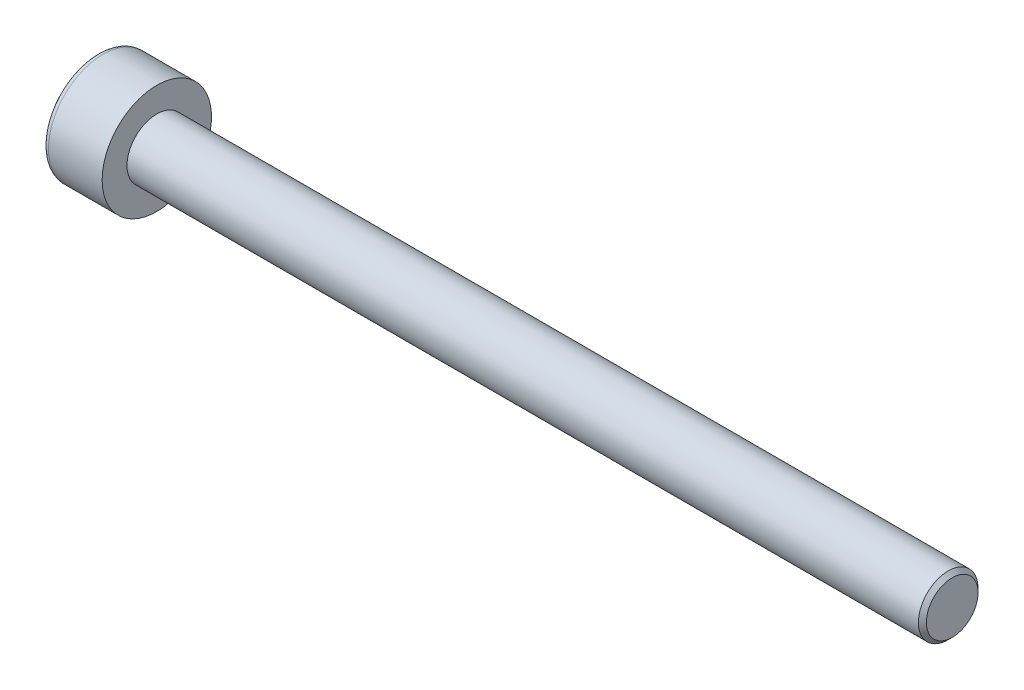
ISO-10303-21;
HEADER;
FILE_DESCRIPTION(('STEP AP214'),'2;1');
FILE_NAME('part.step','',(''),(''),'','','');
FILE_SCHEMA(('AUTOMOTIVE_DESIGN { 1 0 10303 214 1 1 1 1 }'));
ENDSEC;
DATA;
#1=APPLICATION_CONTEXT('core data for automotive mechanical design processes');
#2=APPLICATION_PROTOCOL_DEFINITION('international standard','automotive_design',2000,#1);
#3=PRODUCT_CONTEXT('',#1,'mechanical');
#4=PRODUCT('Part','Part','',(#3));
#5=PRODUCT_RELATED_PRODUCT_CATEGORY('part','',(#4));
#6=PRODUCT_DEFINITION_FORMATION('','',#4);
#7=PRODUCT_DEFINITION_CONTEXT('part definition',#1,'design');
#8=PRODUCT_DEFINITION('design','',#6,#7);
#9=PRODUCT_DEFINITION_SHAPE('','',#8);
#10=(LENGTH_UNIT() NAMED_UNIT(*) SI_UNIT(.MILLI.,.METRE.));
#11=(NAMED_UNIT(*) PLANE_ANGLE_UNIT() SI_UNIT($,.RADIAN.));
#12=(NAMED_UNIT(*) SI_UNIT($,.STERADIAN.) SOLID_ANGLE_UNIT());
#13=UNCERTAINTY_MEASURE_WITH_UNIT(LENGTH_MEASURE(1.E-05),#10,'distance_accuracy_value','');
#14=(GEOMETRIC_REPRESENTATION_CONTEXT(3) GLOBAL_UNCERTAINTY_ASSIGNED_CONTEXT((#13)) GLOBAL_UNIT_ASSIGNED_CONTEXT((#10,
#11,#12)) REPRESENTATION_CONTEXT('',''));
#15=CARTESIAN_POINT('',(0.,0.,0.));
#16=DIRECTION('',(0.,0.,1.));
#17=DIRECTION('',(1.,0.,0.));
#18=AXIS2_PLACEMENT_3D('',#15,#16,#17);
#19=CARTESIAN_POINT('',(0.,0.,0.));
#20=DIRECTION('',(1.,0.,0.));
#21=DIRECTION('',(0.,0.,-1.));
#22=AXIS2_PLACEMENT_3D('',#19,#20,#21);
#23=PLANE('',#22);
#24=DIRECTION('',(0.,0.866025403784438,-0.5));
#25=VECTOR('',#24,1.);
#26=CARTESIAN_POINT('',(0.,0.,1.44337567297406));
#27=LINE('',#26,#25);
#28=CARTESIAN_POINT('',(0.,0.,1.44337567297406));
#29=VERTEX_POINT('',#28);
#30=CARTESIAN_POINT('',(0.,1.25,0.721687836487032));
#31=VERTEX_POINT('',#30);
#32=EDGE_CURVE('E126',#29,#31,#27,.T.);
#33=ORIENTED_EDGE('',*,*,#32,.F.);
#34=DIRECTION('',(0.,0.866025403784439,0.5));
#35=VECTOR('',#34,1.);
#36=CARTESIAN_POINT('',(0.,-1.25,0.721687836487032));
#37=LINE('',#36,#35);
#38=CARTESIAN_POINT('',(0.,-1.25,0.721687836487032));
#39=VERTEX_POINT('',#38);
#40=EDGE_CURVE('E52',#39,#29,#37,.T.);
#41=ORIENTED_EDGE('',*,*,#40,.F.);
#42=DIRECTION('',(0.,0.,1.));
#43=VECTOR('',#42,1.);
#44=CARTESIAN_POINT('',(0.,-1.25,-0.721687836487032));
#45=LINE('',#44,#43);
#46=CARTESIAN_POINT('',(0.,-1.25,-0.721687836487032));
#47=VERTEX_POINT('',#46);
#48=EDGE_CURVE('E135',#47,#39,#45,.T.);
#49=ORIENTED_EDGE('',*,*,#48,.F.);
#50=DIRECTION('',(0.,-0.866025403784439,0.5));
#51=VECTOR('',#50,1.);
#52=CARTESIAN_POINT('',(0.,0.,-1.44337567297406));
#53=LINE('',#52,#51);
#54=CARTESIAN_POINT('',(0.,0.,-1.44337567297406));
#55=VERTEX_POINT('',#54);
#56=EDGE_CURVE('E133',#55,#47,#53,.T.);
#57=ORIENTED_EDGE('',*,*,#56,.F.);
#58=DIRECTION('',(0.,-0.866025403784439,-0.5));
#59=VECTOR('',#58,1.);
#60=CARTESIAN_POINT('',(0.,1.25,-0.721687836487032));
#61=LINE('',#60,#59);
#62=CARTESIAN_POINT('',(0.,1.25,-0.721687836487032));
#63=VERTEX_POINT('',#62);
#64=EDGE_CURVE('E100',#63,#55,#61,.T.);
#65=ORIENTED_EDGE('',*,*,#64,.F.);
#66=DIRECTION('',(0.,0.,-1.));
#67=VECTOR('',#66,1.);
#68=CARTESIAN_POINT('',(0.,1.25,0.721687836487032));
#69=LINE('',#68,#67);
#70=EDGE_CURVE('E129',#31,#63,#69,.T.);
#71=ORIENTED_EDGE('',*,*,#70,.F.);
#72=EDGE_LOOP('',(#33,#41,#49,#57,#65,#71));
#73=FACE_BOUND('',#72,.T.);
#74=CARTESIAN_POINT('',(0.,0.,0.));
#75=DIRECTION('',(-1.,0.,0.));
#76=DIRECTION('',(0.,0.,1.));
#77=AXIS2_PLACEMENT_3D('',#74,#75,#76);
#78=CIRCLE('',#77,2.45);
#79=CARTESIAN_POINT('',(0.,0.,2.45));
#80=VERTEX_POINT('',#79);
#81=EDGE_CURVE('E11',#80,#80,#78,.T.);
#82=ORIENTED_EDGE('',*,*,#81,.T.);
#83=EDGE_LOOP('',(#82));
#84=FACE_BOUND('',#83,.T.);
#85=ADVANCED_FACE('F38',(#73,#84),#23,.F.);
#86=CARTESIAN_POINT('',(0.3,0.,0.));
#87=DIRECTION('',(-1.,0.,0.));
#88=DIRECTION('',(0.,0.,1.));
#89=AXIS2_PLACEMENT_3D('',#86,#87,#88);
#90=TOROIDAL_SURFACE('',#89,2.45,0.3);
#91=ORIENTED_EDGE('',*,*,#81,.F.);
#92=EDGE_LOOP('',(#91));
#93=FACE_BOUND('',#92,.T.);
#94=CARTESIAN_POINT('',(0.300000000000002,0.,0.));
#95=DIRECTION('',(-1.,0.,0.));
#96=DIRECTION('',(0.,0.,1.));
#97=AXIS2_PLACEMENT_3D('',#94,#95,#96);
#98=CIRCLE('',#97,2.75);
#99=CARTESIAN_POINT('',(0.300000000000002,0.,2.75));
#100=VERTEX_POINT('',#99);
#101=EDGE_CURVE('E45',#100,#100,#98,.T.);
#102=ORIENTED_EDGE('',*,*,#101,.T.);
#103=EDGE_LOOP('',(#102));
#104=FACE_BOUND('',#103,.T.);
#105=ADVANCED_FACE('F158',(#93,#104),#90,.T.);
#106=CARTESIAN_POINT('',(0.,0.,0.));
#107=DIRECTION('',(-1.,0.,0.));
#108=DIRECTION('',(0.,0.,1.));
#109=AXIS2_PLACEMENT_3D('',#106,#107,#108);
#110=CYLINDRICAL_SURFACE('',#109,2.75);
#111=ORIENTED_EDGE('',*,*,#101,.F.);
#112=EDGE_LOOP('',(#111));
#113=FACE_BOUND('',#112,.T.);
#114=CARTESIAN_POINT('',(3.,0.,0.));
#115=DIRECTION('',(-1.,0.,0.));
#116=DIRECTION('',(0.,0.,1.));
#117=AXIS2_PLACEMENT_3D('',#114,#115,#116);
#118=CIRCLE('',#117,2.75);
#119=CARTESIAN_POINT('',(3.,0.,2.75));
#120=VERTEX_POINT('',#119);
#121=EDGE_CURVE('E153',#120,#120,#118,.T.);
#122=ORIENTED_EDGE('',*,*,#121,.T.);
#123=EDGE_LOOP('',(#122));
#124=FACE_BOUND('',#123,.T.);
#125=ADVANCED_FACE('F160',(#113,#124),#110,.T.);
#126=CARTESIAN_POINT('',(3.,2.75,0.));
#127=DIRECTION('',(-1.,0.,0.));
#128=DIRECTION('',(0.,0.,1.));
#129=AXIS2_PLACEMENT_3D('',#126,#127,#128);
#130=PLANE('',#129);
#131=ORIENTED_EDGE('',*,*,#121,.F.);
#132=EDGE_LOOP('',(#131));
#133=FACE_BOUND('',#132,.T.);
#134=CARTESIAN_POINT('',(3.,0.,0.));
#135=DIRECTION('',(-1.,0.,0.));
#136=DIRECTION('',(0.,0.,1.));
#137=AXIS2_PLACEMENT_3D('',#134,#135,#136);
#138=CIRCLE('',#137,1.5);
#139=CARTESIAN_POINT('',(3.,0.,1.5));
#140=VERTEX_POINT('',#139);
#141=EDGE_CURVE('E150',#140,#140,#138,.T.);
#142=ORIENTED_EDGE('',*,*,#141,.T.);
#143=EDGE_LOOP('',(#142));
#144=FACE_BOUND('',#143,.T.);
#145=ADVANCED_FACE('F163',(#133,#144),#130,.F.);
#146=CARTESIAN_POINT('',(0.,0.,0.));
#147=DIRECTION('',(-1.,0.,0.));
#148=DIRECTION('',(0.,0.,1.));
#149=AXIS2_PLACEMENT_3D('',#146,#147,#148);
#150=CYLINDRICAL_SURFACE('',#149,1.5);
#151=ORIENTED_EDGE('',*,*,#141,.F.);
#152=EDGE_LOOP('',(#151));
#153=FACE_BOUND('',#152,.T.);
#154=CARTESIAN_POINT('',(42.8,0.,0.));
#155=DIRECTION('',(-1.,0.,0.));
#156=DIRECTION('',(0.,0.,1.));
#157=AXIS2_PLACEMENT_3D('',#154,#155,#156);
#158=CIRCLE('',#157,1.5);
#159=CARTESIAN_POINT('',(42.8,0.,1.5));
#160=VERTEX_POINT('',#159);
#161=EDGE_CURVE('E147',#160,#160,#158,.T.);
#162=ORIENTED_EDGE('',*,*,#161,.T.);
#163=EDGE_LOOP('',(#162));
#164=FACE_BOUND('',#163,.T.);
#165=ADVANCED_FACE('F169',(#153,#164),#150,.T.);
#166=CARTESIAN_POINT('',(43.,0.,0.));
#167=DIRECTION('',(-1.,0.,0.));
#168=DIRECTION('',(0.,0.,1.));
#169=AXIS2_PLACEMENT_3D('',#166,#167,#168);
#170=CONICAL_SURFACE('',#169,1.3,0.785398163397448);
#171=ORIENTED_EDGE('',*,*,#161,.F.);
#172=EDGE_LOOP('',(#171));
#173=FACE_BOUND('',#172,.T.);
#174=CARTESIAN_POINT('',(43.,0.,0.));
#175=DIRECTION('',(-1.,0.,0.));
#176=DIRECTION('',(0.,0.,1.));
#177=AXIS2_PLACEMENT_3D('',#174,#175,#176);
#178=CIRCLE('',#177,1.3);
#179=CARTESIAN_POINT('',(43.,0.,1.3));
#180=VERTEX_POINT('',#179);
#181=EDGE_CURVE('E139',#180,#180,#178,.T.);
#182=ORIENTED_EDGE('',*,*,#181,.T.);
#183=EDGE_LOOP('',(#182));
#184=FACE_BOUND('',#183,.T.);
#185=ADVANCED_FACE('F175',(#173,#184),#170,.T.);
#186=CARTESIAN_POINT('',(43.,1.3,0.));
#187=DIRECTION('',(-1.,0.,0.));
#188=DIRECTION('',(0.,0.,1.));
#189=AXIS2_PLACEMENT_3D('',#186,#187,#188);
#190=PLANE('',#189);
#191=ORIENTED_EDGE('',*,*,#181,.F.);
#192=EDGE_LOOP('',(#191));
#193=FACE_BOUND('',#192,.T.);
#194=ADVANCED_FACE('F181',(#193),#190,.F.);
#195=CARTESIAN_POINT('',(1.5,-1.25,0.721687836487032));
#196=DIRECTION('',(0.,-0.5,0.866025403784439));
#197=DIRECTION('',(0.,-0.866025403784439,-0.5));
#198=AXIS2_PLACEMENT_3D('',#195,#196,#197);
#199=PLANE('',#198);
#200=ORIENTED_EDGE('',*,*,#40,.T.);
#201=DIRECTION('',(-1.,0.,0.));
#202=VECTOR('',#201,1.);
#203=CARTESIAN_POINT('',(1.5,0.,1.44337567297406));
#204=LINE('',#203,#202);
#205=CARTESIAN_POINT('',(1.5,0.,1.44337567297406));
#206=VERTEX_POINT('',#205);
#207=EDGE_CURVE('E82',#206,#29,#204,.T.);
#208=ORIENTED_EDGE('',*,*,#207,.F.);
#209=DIRECTION('',(0.,0.866025403784439,0.5));
#210=VECTOR('',#209,1.);
#211=CARTESIAN_POINT('',(1.5,-1.25,0.721687836487032));
#212=LINE('',#211,#210);
#213=CARTESIAN_POINT('',(1.5,-1.25,0.721687836487032));
#214=VERTEX_POINT('',#213);
#215=EDGE_CURVE('E137',#214,#206,#212,.T.);
#216=ORIENTED_EDGE('',*,*,#215,.F.);
#217=DIRECTION('',(-1.,0.,0.));
#218=VECTOR('',#217,1.);
#219=CARTESIAN_POINT('',(1.5,-1.25,0.721687836487032));
#220=LINE('',#219,#218);
#221=EDGE_CURVE('E60',#214,#39,#220,.T.);
#222=ORIENTED_EDGE('',*,*,#221,.T.);
#223=EDGE_LOOP('',(#200,#208,#216,#222));
#224=FACE_BOUND('',#223,.T.);
#225=ADVANCED_FACE('F186',(#224),#199,.F.);
#226=CARTESIAN_POINT('',(1.5,-1.25,-0.721687836487032));
#227=DIRECTION('',(0.,-1.,0.));
#228=DIRECTION('',(0.,0.,-1.));
#229=AXIS2_PLACEMENT_3D('',#226,#227,#228);
#230=PLANE('',#229);
#231=ORIENTED_EDGE('',*,*,#48,.T.);
#232=ORIENTED_EDGE('',*,*,#221,.F.);
#233=DIRECTION('',(0.,0.,1.));
#234=VECTOR('',#233,1.);
#235=CARTESIAN_POINT('',(1.5,-1.25,-0.721687836487032));
#236=LINE('',#235,#234);
#237=CARTESIAN_POINT('',(1.5,-1.25,-0.721687836487032));
#238=VERTEX_POINT('',#237);
#239=EDGE_CURVE('E112',#238,#214,#236,.T.);
#240=ORIENTED_EDGE('',*,*,#239,.F.);
#241=DIRECTION('',(-1.,0.,0.));
#242=VECTOR('',#241,1.);
#243=CARTESIAN_POINT('',(1.5,-1.25,-0.721687836487032));
#244=LINE('',#243,#242);
#245=EDGE_CURVE('E104',#238,#47,#244,.T.);
#246=ORIENTED_EDGE('',*,*,#245,.T.);
#247=EDGE_LOOP('',(#231,#232,#240,#246));
#248=FACE_BOUND('',#247,.T.);
#249=ADVANCED_FACE('F191',(#248),#230,.F.);
#250=CARTESIAN_POINT('',(1.5,0.,-1.44337567297406));
#251=DIRECTION('',(0.,-0.5,-0.866025403784438));
#252=DIRECTION('',(0.,0.866025403784439,-0.5));
#253=AXIS2_PLACEMENT_3D('',#250,#251,#252);
#254=PLANE('',#253);
#255=ORIENTED_EDGE('',*,*,#56,.T.);
#256=ORIENTED_EDGE('',*,*,#245,.F.);
#257=DIRECTION('',(0.,-0.866025403784439,0.5));
#258=VECTOR('',#257,1.);
#259=CARTESIAN_POINT('',(1.5,0.,-1.44337567297406));
#260=LINE('',#259,#258);
#261=CARTESIAN_POINT('',(1.5,0.,-1.44337567297406));
#262=VERTEX_POINT('',#261);
#263=EDGE_CURVE('E108',#262,#238,#260,.T.);
#264=ORIENTED_EDGE('',*,*,#263,.F.);
#265=DIRECTION('',(-1.,0.,0.));
#266=VECTOR('',#265,1.);
#267=CARTESIAN_POINT('',(1.5,0.,-1.44337567297406));
#268=LINE('',#267,#266);
#269=EDGE_CURVE('E93',#262,#55,#268,.T.);
#270=ORIENTED_EDGE('',*,*,#269,.T.);
#271=EDGE_LOOP('',(#255,#256,#264,#270));
#272=FACE_BOUND('',#271,.T.);
#273=ADVANCED_FACE('F109',(#272),#254,.F.);
#274=CARTESIAN_POINT('',(1.5,1.25,-0.721687836487032));
#275=DIRECTION('',(0.,0.5,-0.866025403784439));
#276=DIRECTION('',(0.,0.866025403784439,0.5));
#277=AXIS2_PLACEMENT_3D('',#274,#275,#276);
#278=PLANE('',#277);
#279=ORIENTED_EDGE('',*,*,#64,.T.);
#280=ORIENTED_EDGE('',*,*,#269,.F.);
#281=DIRECTION('',(0.,-0.866025403784439,-0.5));
#282=VECTOR('',#281,1.);
#283=CARTESIAN_POINT('',(1.5,1.25,-0.721687836487032));
#284=LINE('',#283,#282);
#285=CARTESIAN_POINT('',(1.5,1.25,-0.721687836487032));
#286=VERTEX_POINT('',#285);
#287=EDGE_CURVE('E97',#286,#262,#284,.T.);
#288=ORIENTED_EDGE('',*,*,#287,.F.);
#289=DIRECTION('',(-1.,0.,0.));
#290=VECTOR('',#289,1.);
#291=CARTESIAN_POINT('',(1.5,1.25,-0.721687836487032));
#292=LINE('',#291,#290);
#293=EDGE_CURVE('E105',#286,#63,#292,.T.);
#294=ORIENTED_EDGE('',*,*,#293,.T.);
#295=EDGE_LOOP('',(#279,#280,#288,#294));
#296=FACE_BOUND('',#295,.T.);
#297=ADVANCED_FACE('F95',(#296),#278,.F.);
#298=CARTESIAN_POINT('',(1.5,1.25,0.721687836487032));
#299=DIRECTION('',(0.,1.,0.));
#300=DIRECTION('',(0.,0.,1.));
#301=AXIS2_PLACEMENT_3D('',#298,#299,#300);
#302=PLANE('',#301);
#303=ORIENTED_EDGE('',*,*,#70,.T.);
#304=ORIENTED_EDGE('',*,*,#293,.F.);
#305=DIRECTION('',(0.,0.,-1.));
#306=VECTOR('',#305,1.);
#307=CARTESIAN_POINT('',(1.5,1.25,0.721687836487032));
#308=LINE('',#307,#306);
#309=CARTESIAN_POINT('',(1.5,1.25,0.721687836487032));
#310=VERTEX_POINT('',#309);
#311=EDGE_CURVE('E118',#310,#286,#308,.T.);
#312=ORIENTED_EDGE('',*,*,#311,.F.);
#313=DIRECTION('',(-1.,0.,0.));
#314=VECTOR('',#313,1.);
#315=CARTESIAN_POINT('',(1.5,1.25,0.721687836487032));
#316=LINE('',#315,#314);
#317=EDGE_CURVE('E142',#310,#31,#316,.T.);
#318=ORIENTED_EDGE('',*,*,#317,.T.);
#319=EDGE_LOOP('',(#303,#304,#312,#318));
#320=FACE_BOUND('',#319,.T.);
#321=ADVANCED_FACE('F217',(#320),#302,.F.);
#322=CARTESIAN_POINT('',(1.5,0.,1.44337567297406));
#323=DIRECTION('',(0.,0.5,0.866025403784438));
#324=DIRECTION('',(0.,-0.866025403784438,0.5));
#325=AXIS2_PLACEMENT_3D('',#322,#323,#324);
#326=PLANE('',#325);
#327=ORIENTED_EDGE('',*,*,#32,.T.);
#328=ORIENTED_EDGE('',*,*,#317,.F.);
#329=DIRECTION('',(0.,0.866025403784438,-0.5));
#330=VECTOR('',#329,1.);
#331=CARTESIAN_POINT('',(1.5,0.,1.44337567297406));
#332=LINE('',#331,#330);
#333=EDGE_CURVE('E120',#206,#310,#332,.T.);
#334=ORIENTED_EDGE('',*,*,#333,.F.);
#335=ORIENTED_EDGE('',*,*,#207,.T.);
#336=EDGE_LOOP('',(#327,#328,#334,#335));
#337=FACE_BOUND('',#336,.T.);
#338=ADVANCED_FACE('F205',(#337),#326,.F.);
#339=CARTESIAN_POINT('',(1.5,0.,0.));
#340=DIRECTION('',(-1.,0.,0.));
#341=DIRECTION('',(0.,0.,1.));
#342=AXIS2_PLACEMENT_3D('',#339,#340,#341);
#343=PLANE('',#342);
#344=ORIENTED_EDGE('',*,*,#215,.T.);
#345=ORIENTED_EDGE('',*,*,#333,.T.);
#346=ORIENTED_EDGE('',*,*,#311,.T.);
#347=ORIENTED_EDGE('',*,*,#287,.T.);
#348=ORIENTED_EDGE('',*,*,#263,.T.);
#349=ORIENTED_EDGE('',*,*,#239,.T.);
#350=EDGE_LOOP('',(#344,#345,#346,#347,#348,#349));
#351=FACE_BOUND('',#350,.T.);
#352=ADVANCED_FACE('F115',(#351),#343,.T.);
#353=CLOSED_SHELL('',(#85,#105,#125,#145,#165,#185,#194,#225,#249,#273,#297,#321,#338,#352));
#354=MANIFOLD_SOLID_BREP('B2',#353);
#355=ADVANCED_BREP_SHAPE_REPRESENTATION('',(#18,#354),#14);
#356=SHAPE_DEFINITION_REPRESENTATION(#9,#355);
ENDSEC;
END-ISO-10303-21;
